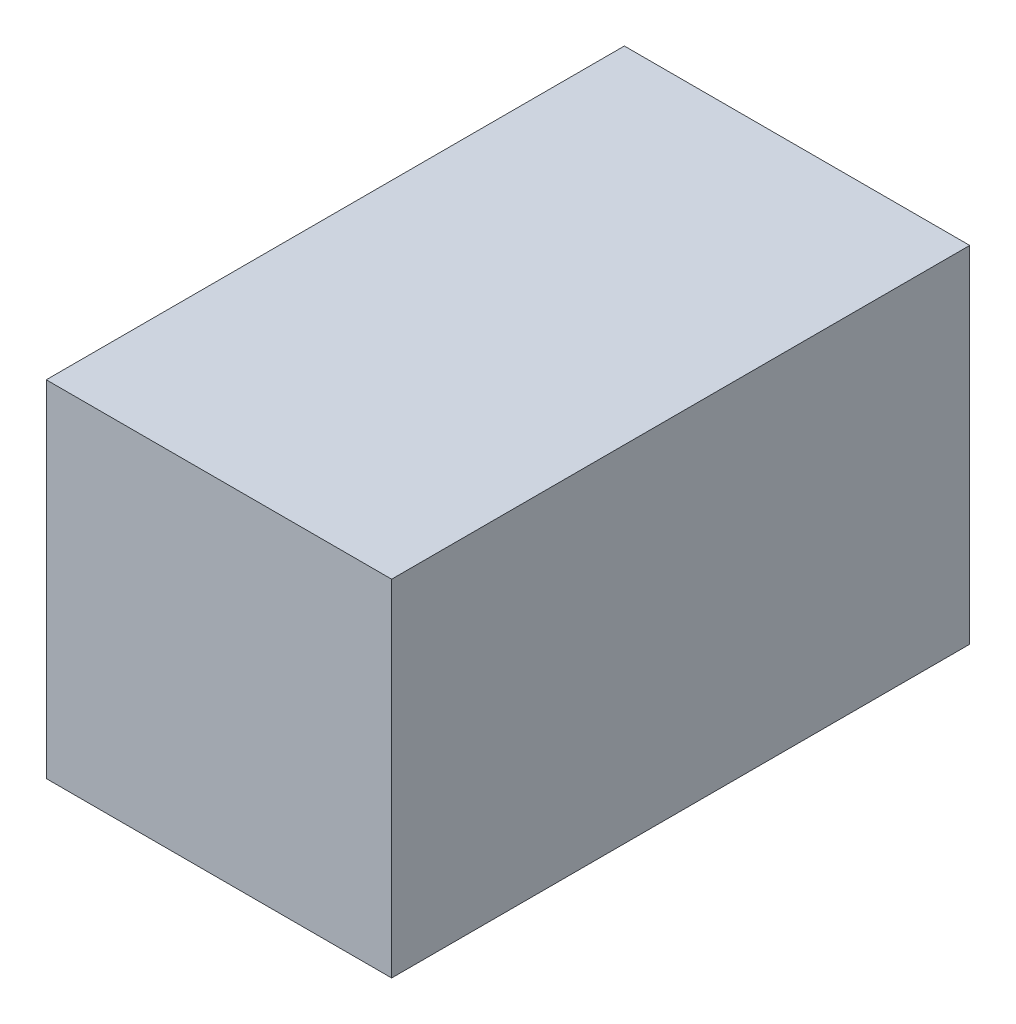
ISO-10303-21;
HEADER;
FILE_DESCRIPTION(('STEP AP214'),'2;1');
FILE_NAME('part.step','',(''),(''),'','','');
FILE_SCHEMA(('AUTOMOTIVE_DESIGN { 1 0 10303 214 1 1 1 1 }'));
ENDSEC;
DATA;
#1=APPLICATION_CONTEXT('core data for automotive mechanical design processes');
#2=APPLICATION_PROTOCOL_DEFINITION('international standard','automotive_design',2000,#1);
#3=PRODUCT_CONTEXT('',#1,'mechanical');
#4=PRODUCT('Part','Part','',(#3));
#5=PRODUCT_RELATED_PRODUCT_CATEGORY('part','',(#4));
#6=PRODUCT_DEFINITION_FORMATION('','',#4);
#7=PRODUCT_DEFINITION_CONTEXT('part definition',#1,'design');
#8=PRODUCT_DEFINITION('design','',#6,#7);
#9=PRODUCT_DEFINITION_SHAPE('','',#8);
#10=(LENGTH_UNIT() NAMED_UNIT(*) SI_UNIT(.MILLI.,.METRE.));
#11=(NAMED_UNIT(*) PLANE_ANGLE_UNIT() SI_UNIT($,.RADIAN.));
#12=(NAMED_UNIT(*) SI_UNIT($,.STERADIAN.) SOLID_ANGLE_UNIT());
#13=UNCERTAINTY_MEASURE_WITH_UNIT(LENGTH_MEASURE(1.E-05),#10,'distance_accuracy_value','');
#14=(GEOMETRIC_REPRESENTATION_CONTEXT(3) GLOBAL_UNCERTAINTY_ASSIGNED_CONTEXT((#13)) GLOBAL_UNIT_ASSIGNED_CONTEXT((#10,
#11,#12)) REPRESENTATION_CONTEXT('',''));
#15=CARTESIAN_POINT('',(0.,0.,0.));
#16=DIRECTION('',(0.,0.,1.));
#17=DIRECTION('',(1.,0.,0.));
#18=AXIS2_PLACEMENT_3D('',#15,#16,#17);
#19=CARTESIAN_POINT('',(22.225,22.225,-39.4));
#20=DIRECTION('',(1.,0.,0.));
#21=DIRECTION('',(0.,1.,0.));
#22=AXIS2_PLACEMENT_3D('',#19,#20,#21);
#23=PLANE('',#22);
#24=DIRECTION('',(0.,0.,1.));
#25=VECTOR('',#24,1.);
#26=CARTESIAN_POINT('',(22.225,22.225,-39.4));
#27=LINE('',#26,#25);
#28=CARTESIAN_POINT('',(22.225,22.225,-39.4));
#29=VERTEX_POINT('',#28);
#30=CARTESIAN_POINT('',(22.225,22.225,35.));
#31=VERTEX_POINT('',#30);
#32=EDGE_CURVE('E46',#29,#31,#27,.T.);
#33=ORIENTED_EDGE('',*,*,#32,.T.);
#34=DIRECTION('',(0.,1.,0.));
#35=VECTOR('',#34,1.);
#36=CARTESIAN_POINT('',(22.225,22.225,35.));
#37=LINE('',#36,#35);
#38=CARTESIAN_POINT('',(22.225,-22.225,35.));
#39=VERTEX_POINT('',#38);
#40=EDGE_CURVE('E84',#39,#31,#37,.T.);
#41=ORIENTED_EDGE('',*,*,#40,.F.);
#42=DIRECTION('',(0.,0.,1.));
#43=VECTOR('',#42,1.);
#44=CARTESIAN_POINT('',(22.225,-22.225,-39.4));
#45=LINE('',#44,#43);
#46=CARTESIAN_POINT('',(22.225,-22.225,-39.4));
#47=VERTEX_POINT('',#46);
#48=EDGE_CURVE('E11',#47,#39,#45,.T.);
#49=ORIENTED_EDGE('',*,*,#48,.F.);
#50=DIRECTION('',(0.,1.,0.));
#51=VECTOR('',#50,1.);
#52=CARTESIAN_POINT('',(22.225,22.225,-39.4));
#53=LINE('',#52,#51);
#54=EDGE_CURVE('E85',#47,#29,#53,.T.);
#55=ORIENTED_EDGE('',*,*,#54,.T.);
#56=EDGE_LOOP('',(#33,#41,#49,#55));
#57=FACE_BOUND('',#56,.T.);
#58=ADVANCED_FACE('F43',(#57),#23,.T.);
#59=CARTESIAN_POINT('',(-22.225,-22.225,-39.4));
#60=DIRECTION('',(0.,-1.,0.));
#61=DIRECTION('',(0.,0.,-1.));
#62=AXIS2_PLACEMENT_3D('',#59,#60,#61);
#63=PLANE('',#62);
#64=ORIENTED_EDGE('',*,*,#48,.T.);
#65=DIRECTION('',(1.,0.,0.));
#66=VECTOR('',#65,1.);
#67=CARTESIAN_POINT('',(-22.225,-22.225,35.));
#68=LINE('',#67,#66);
#69=CARTESIAN_POINT('',(-22.225,-22.225,35.));
#70=VERTEX_POINT('',#69);
#71=EDGE_CURVE('E103',#70,#39,#68,.T.);
#72=ORIENTED_EDGE('',*,*,#71,.F.);
#73=DIRECTION('',(0.,0.,1.));
#74=VECTOR('',#73,1.);
#75=CARTESIAN_POINT('',(-22.225,-22.225,-39.4));
#76=LINE('',#75,#74);
#77=CARTESIAN_POINT('',(-22.225,-22.225,-39.4));
#78=VERTEX_POINT('',#77);
#79=EDGE_CURVE('E52',#78,#70,#76,.T.);
#80=ORIENTED_EDGE('',*,*,#79,.F.);
#81=DIRECTION('',(1.,0.,0.));
#82=VECTOR('',#81,1.);
#83=CARTESIAN_POINT('',(-22.225,-22.225,-39.4));
#84=LINE('',#83,#82);
#85=EDGE_CURVE('E91',#78,#47,#84,.T.);
#86=ORIENTED_EDGE('',*,*,#85,.T.);
#87=EDGE_LOOP('',(#64,#72,#80,#86));
#88=FACE_BOUND('',#87,.T.);
#89=ADVANCED_FACE('F127',(#88),#63,.T.);
#90=CARTESIAN_POINT('',(-22.225,22.225,-39.4));
#91=DIRECTION('',(-1.,0.,0.));
#92=DIRECTION('',(0.,-1.,0.));
#93=AXIS2_PLACEMENT_3D('',#90,#91,#92);
#94=PLANE('',#93);
#95=ORIENTED_EDGE('',*,*,#79,.T.);
#96=DIRECTION('',(0.,-1.,0.));
#97=VECTOR('',#96,1.);
#98=CARTESIAN_POINT('',(-22.225,22.225,35.));
#99=LINE('',#98,#97);
#100=CARTESIAN_POINT('',(-22.225,22.225,35.));
#101=VERTEX_POINT('',#100);
#102=EDGE_CURVE('E99',#101,#70,#99,.T.);
#103=ORIENTED_EDGE('',*,*,#102,.F.);
#104=DIRECTION('',(0.,0.,1.));
#105=VECTOR('',#104,1.);
#106=CARTESIAN_POINT('',(-22.225,22.225,-39.4));
#107=LINE('',#106,#105);
#108=CARTESIAN_POINT('',(-22.225,22.225,-39.4));
#109=VERTEX_POINT('',#108);
#110=EDGE_CURVE('E90',#109,#101,#107,.T.);
#111=ORIENTED_EDGE('',*,*,#110,.F.);
#112=DIRECTION('',(0.,-1.,0.));
#113=VECTOR('',#112,1.);
#114=CARTESIAN_POINT('',(-22.225,22.225,-39.4));
#115=LINE('',#114,#113);
#116=EDGE_CURVE('E116',#109,#78,#115,.T.);
#117=ORIENTED_EDGE('',*,*,#116,.T.);
#118=EDGE_LOOP('',(#95,#103,#111,#117));
#119=FACE_BOUND('',#118,.T.);
#120=ADVANCED_FACE('F124',(#119),#94,.T.);
#121=CARTESIAN_POINT('',(-22.225,22.225,-39.4));
#122=DIRECTION('',(0.,1.,0.));
#123=DIRECTION('',(0.,0.,1.));
#124=AXIS2_PLACEMENT_3D('',#121,#122,#123);
#125=PLANE('',#124);
#126=ORIENTED_EDGE('',*,*,#110,.T.);
#127=DIRECTION('',(-1.,0.,0.));
#128=VECTOR('',#127,1.);
#129=CARTESIAN_POINT('',(-22.225,22.225,35.));
#130=LINE('',#129,#128);
#131=EDGE_CURVE('E93',#31,#101,#130,.T.);
#132=ORIENTED_EDGE('',*,*,#131,.F.);
#133=ORIENTED_EDGE('',*,*,#32,.F.);
#134=DIRECTION('',(-1.,0.,0.));
#135=VECTOR('',#134,1.);
#136=CARTESIAN_POINT('',(-22.225,22.225,-39.4));
#137=LINE('',#136,#135);
#138=EDGE_CURVE('E113',#29,#109,#137,.T.);
#139=ORIENTED_EDGE('',*,*,#138,.T.);
#140=EDGE_LOOP('',(#126,#132,#133,#139));
#141=FACE_BOUND('',#140,.T.);
#142=ADVANCED_FACE('F94',(#141),#125,.T.);
#143=CARTESIAN_POINT('',(0.,0.,-39.4));
#144=DIRECTION('',(0.,0.,1.));
#145=DIRECTION('',(1.,0.,0.));
#146=AXIS2_PLACEMENT_3D('',#143,#144,#145);
#147=PLANE('',#146);
#148=ORIENTED_EDGE('',*,*,#54,.F.);
#149=ORIENTED_EDGE('',*,*,#85,.F.);
#150=ORIENTED_EDGE('',*,*,#116,.F.);
#151=ORIENTED_EDGE('',*,*,#138,.F.);
#152=EDGE_LOOP('',(#148,#149,#150,#151));
#153=FACE_BOUND('',#152,.T.);
#154=ADVANCED_FACE('F129',(#153),#147,.F.);
#155=CARTESIAN_POINT('',(0.,0.,35.));
#156=DIRECTION('',(0.,0.,1.));
#157=DIRECTION('',(1.,0.,0.));
#158=AXIS2_PLACEMENT_3D('',#155,#156,#157);
#159=PLANE('',#158);
#160=ORIENTED_EDGE('',*,*,#40,.T.);
#161=ORIENTED_EDGE('',*,*,#131,.T.);
#162=ORIENTED_EDGE('',*,*,#102,.T.);
#163=ORIENTED_EDGE('',*,*,#71,.T.);
#164=EDGE_LOOP('',(#160,#161,#162,#163));
#165=FACE_BOUND('',#164,.T.);
#166=ADVANCED_FACE('F102',(#165),#159,.T.);
#167=CLOSED_SHELL('',(#58,#89,#120,#142,#154,#166));
#168=MANIFOLD_SOLID_BREP('B2',#167);
#169=ADVANCED_BREP_SHAPE_REPRESENTATION('',(#18,#168),#14);
#170=SHAPE_DEFINITION_REPRESENTATION(#9,#169);
ENDSEC;
END-ISO-10303-21;
